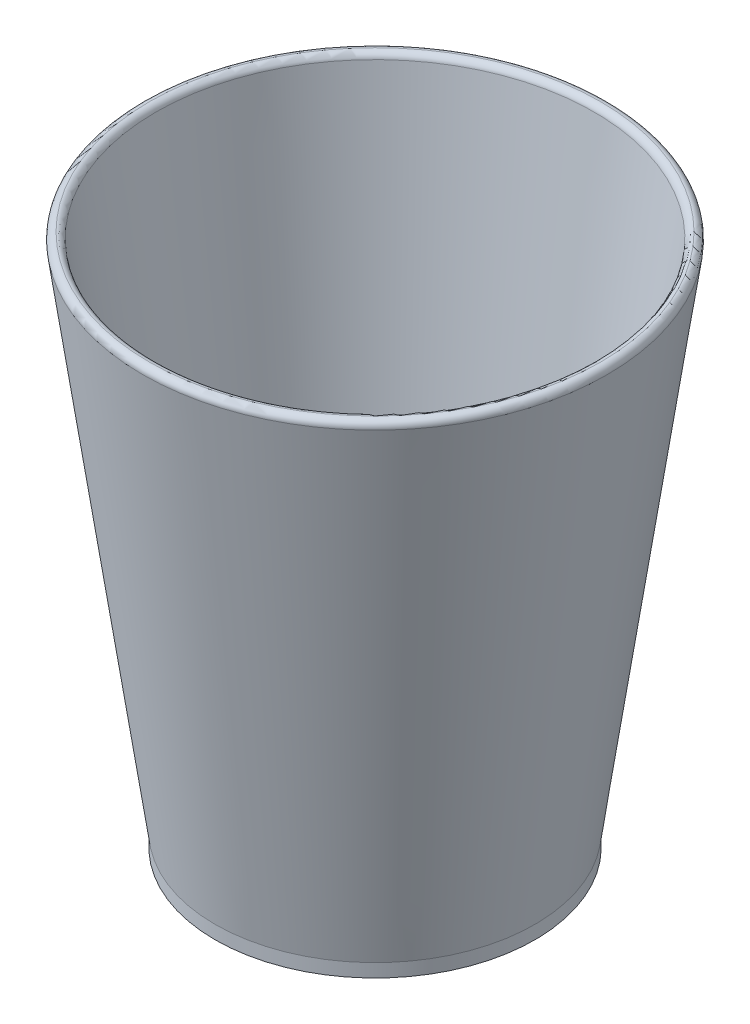
ISO-10303-21;
HEADER;
FILE_DESCRIPTION(('STEP AP214'),'2;1');
FILE_NAME('part.step','',(''),(''),'','','');
FILE_SCHEMA(('AUTOMOTIVE_DESIGN { 1 0 10303 214 1 1 1 1 }'));
ENDSEC;
DATA;
#1=APPLICATION_CONTEXT('core data for automotive mechanical design processes');
#2=APPLICATION_PROTOCOL_DEFINITION('international standard','automotive_design',2000,#1);
#3=PRODUCT_CONTEXT('',#1,'mechanical');
#4=PRODUCT('Part','Part','',(#3));
#5=PRODUCT_RELATED_PRODUCT_CATEGORY('part','',(#4));
#6=PRODUCT_DEFINITION_FORMATION('','',#4);
#7=PRODUCT_DEFINITION_CONTEXT('part definition',#1,'design');
#8=PRODUCT_DEFINITION('design','',#6,#7);
#9=PRODUCT_DEFINITION_SHAPE('','',#8);
#10=(LENGTH_UNIT() NAMED_UNIT(*) SI_UNIT(.MILLI.,.METRE.));
#11=(NAMED_UNIT(*) PLANE_ANGLE_UNIT() SI_UNIT($,.RADIAN.));
#12=(NAMED_UNIT(*) SI_UNIT($,.STERADIAN.) SOLID_ANGLE_UNIT());
#13=UNCERTAINTY_MEASURE_WITH_UNIT(LENGTH_MEASURE(1.E-05),#10,'distance_accuracy_value','');
#14=(GEOMETRIC_REPRESENTATION_CONTEXT(3) GLOBAL_UNCERTAINTY_ASSIGNED_CONTEXT((#13)) GLOBAL_UNIT_ASSIGNED_CONTEXT((#10,
#11,#12)) REPRESENTATION_CONTEXT('',''));
#15=CARTESIAN_POINT('',(0.,0.,0.));
#16=DIRECTION('',(0.,0.,1.));
#17=DIRECTION('',(1.,0.,0.));
#18=AXIS2_PLACEMENT_3D('',#15,#16,#17);
#19=CARTESIAN_POINT('',(0.,2.,0.));
#20=DIRECTION('',(0.,-1.,0.));
#21=DIRECTION('',(0.,0.,-1.));
#22=AXIS2_PLACEMENT_3D('',#19,#20,#21);
#23=CYLINDRICAL_SURFACE('',#22,24.);
#24=CARTESIAN_POINT('',(0.,2.,0.));
#25=DIRECTION('',(0.,1.,0.));
#26=DIRECTION('',(0.,0.,1.));
#27=AXIS2_PLACEMENT_3D('',#24,#25,#26);
#28=CIRCLE('',#27,24.);
#29=CARTESIAN_POINT('',(0.,2.,24.));
#30=VERTEX_POINT('',#29);
#31=EDGE_CURVE('E51',#30,#30,#28,.T.);
#32=ORIENTED_EDGE('',*,*,#31,.F.);
#33=EDGE_LOOP('',(#32));
#34=FACE_BOUND('',#33,.T.);
#35=CARTESIAN_POINT('',(0.,0.,0.));
#36=DIRECTION('',(0.,1.,0.));
#37=DIRECTION('',(0.,0.,1.));
#38=AXIS2_PLACEMENT_3D('',#35,#36,#37);
#39=CIRCLE('',#38,24.);
#40=CARTESIAN_POINT('',(0.,0.,24.));
#41=VERTEX_POINT('',#40);
#42=EDGE_CURVE('E52',#41,#41,#39,.T.);
#43=ORIENTED_EDGE('',*,*,#42,.T.);
#44=EDGE_LOOP('',(#43));
#45=FACE_BOUND('',#44,.T.);
#46=ADVANCED_FACE('F31',(#34,#45),#23,.T.);
#47=CARTESIAN_POINT('',(0.,0.,0.));
#48=DIRECTION('',(0.,1.,0.));
#49=DIRECTION('',(0.,0.,1.));
#50=AXIS2_PLACEMENT_3D('',#47,#48,#49);
#51=PLANE('',#50);
#52=ORIENTED_EDGE('',*,*,#42,.F.);
#53=EDGE_LOOP('',(#52));
#54=FACE_BOUND('',#53,.T.);
#55=ADVANCED_FACE('F62',(#54),#51,.F.);
#56=CARTESIAN_POINT('',(0.,2.,0.));
#57=DIRECTION('',(0.,1.,0.));
#58=DIRECTION('',(-1.,0.,0.));
#59=AXIS2_PLACEMENT_3D('',#56,#57,#58);
#60=CONICAL_SURFACE('',#59,24.,0.14010172439663);
#61=CARTESIAN_POINT('',(0.,78.8603561569532,0.));
#62=DIRECTION('',(0.,-1.,0.));
#63=DIRECTION('',(1.,0.,0.));
#64=AXIS2_PLACEMENT_3D('',#61,#62,#63);
#65=CIRCLE('',#64,34.8392809964934);
#66=CARTESIAN_POINT('',(34.8392809964934,78.8603561569532,0.));
#67=VERTEX_POINT('',#66);
#68=EDGE_CURVE('E42',#67,#67,#65,.T.);
#69=ORIENTED_EDGE('',*,*,#68,.T.);
#70=EDGE_LOOP('',(#69));
#71=FACE_BOUND('',#70,.T.);
#72=ORIENTED_EDGE('',*,*,#31,.T.);
#73=EDGE_LOOP('',(#72));
#74=FACE_BOUND('',#73,.T.);
#75=ADVANCED_FACE('F58',(#71,#74),#60,.T.);
#76=CARTESIAN_POINT('',(0.,80.,0.));
#77=DIRECTION('',(0.,1.,0.));
#78=DIRECTION('',(-1.,0.,0.));
#79=AXIS2_PLACEMENT_3D('',#76,#77,#78);
#80=CONICAL_SURFACE('',#79,33.,0.14010172439663);
#81=CARTESIAN_POINT('',(0.,79.1398402391796,0.));
#82=DIRECTION('',(0.,1.,0.));
#83=DIRECTION('',(-1.,0.,0.));
#84=AXIS2_PLACEMENT_3D('',#81,#82,#83);
#85=CIRCLE('',#84,32.8786954183458);
#86=CARTESIAN_POINT('',(-32.8786954183458,79.1398402391796,0.));
#87=VERTEX_POINT('',#86);
#88=EDGE_CURVE('E10',#87,#87,#85,.T.);
#89=ORIENTED_EDGE('',*,*,#88,.T.);
#90=EDGE_LOOP('',(#89));
#91=FACE_BOUND('',#90,.T.);
#92=CARTESIAN_POINT('',(0.,2.,0.));
#93=DIRECTION('',(0.,1.,0.));
#94=DIRECTION('',(0.,0.,1.));
#95=AXIS2_PLACEMENT_3D('',#92,#93,#94);
#96=CIRCLE('',#95,22.);
#97=CARTESIAN_POINT('',(0.,2.,22.));
#98=VERTEX_POINT('',#97);
#99=EDGE_CURVE('E46',#98,#98,#96,.F.);
#100=ORIENTED_EDGE('',*,*,#99,.T.);
#101=EDGE_LOOP('',(#100));
#102=FACE_BOUND('',#101,.T.);
#103=ADVANCED_FACE('F71',(#91,#102),#80,.F.);
#104=CARTESIAN_POINT('',(0.,2.,0.));
#105=DIRECTION('',(0.,1.,0.));
#106=DIRECTION('',(0.,0.,1.));
#107=AXIS2_PLACEMENT_3D('',#104,#105,#106);
#108=PLANE('',#107);
#109=ORIENTED_EDGE('',*,*,#99,.F.);
#110=EDGE_LOOP('',(#109));
#111=FACE_BOUND('',#110,.T.);
#112=ADVANCED_FACE('F75',(#111),#108,.T.);
#113=CARTESIAN_POINT('',(0.,79.,0.));
#114=DIRECTION('',(0.,1.,0.));
#115=DIRECTION('',(-1.,0.,0.));
#116=AXIS2_PLACEMENT_3D('',#113,#114,#115);
#117=TOROIDAL_SURFACE('',#116,33.8490792003432,1.);
#118=CARTESIAN_POINT('',(0.,80.,0.));
#119=DIRECTION('',(0.,1.,0.));
#120=DIRECTION('',(-1.,0.,0.));
#121=AXIS2_PLACEMENT_3D('',#118,#119,#120);
#122=CIRCLE('',#121,33.8490792003432);
#123=CARTESIAN_POINT('',(-33.8490792003432,80.,0.));
#124=VERTEX_POINT('',#123);
#125=EDGE_CURVE('E38',#124,#124,#122,.T.);
#126=ORIENTED_EDGE('',*,*,#125,.F.);
#127=EDGE_LOOP('',(#126));
#128=FACE_BOUND('',#127,.T.);
#129=ORIENTED_EDGE('',*,*,#68,.F.);
#130=EDGE_LOOP('',(#129));
#131=FACE_BOUND('',#130,.T.);
#132=ADVANCED_FACE('F76',(#128,#131),#117,.T.);
#133=CARTESIAN_POINT('',(0.,79.0001963961328,0.));
#134=DIRECTION('',(0.,1.,0.));
#135=DIRECTION('',(-1.,0.,0.));
#136=AXIS2_PLACEMENT_3D('',#133,#134,#135);
#137=TOROIDAL_SURFACE('',#136,33.8688972144961,1.);
#138=ORIENTED_EDGE('',*,*,#88,.F.);
#139=EDGE_LOOP('',(#138));
#140=FACE_BOUND('',#139,.T.);
#141=ORIENTED_EDGE('',*,*,#125,.T.);
#142=EDGE_LOOP('',(#141));
#143=FACE_BOUND('',#142,.T.);
#144=ADVANCED_FACE('F33',(#140,#143),#137,.T.);
#145=CLOSED_SHELL('',(#46,#55,#75,#103,#112,#132,#144));
#146=MANIFOLD_SOLID_BREP('B2',#145);
#147=ADVANCED_BREP_SHAPE_REPRESENTATION('',(#18,#146),#14);
#148=SHAPE_DEFINITION_REPRESENTATION(#9,#147);
ENDSEC;
END-ISO-10303-21;
